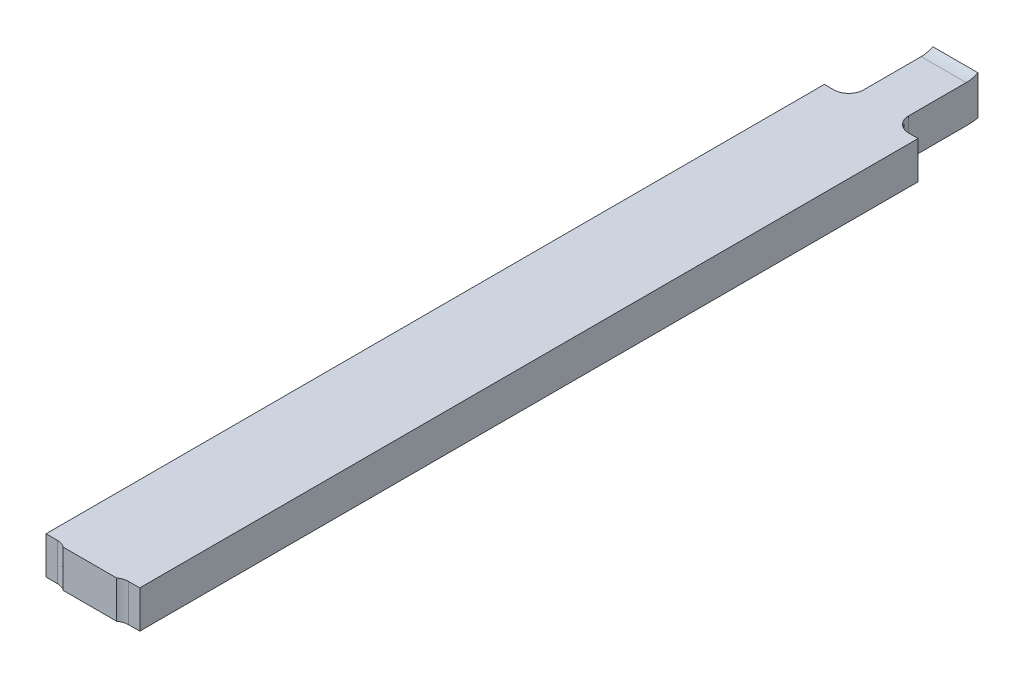
ISO-10303-21;
HEADER;
FILE_DESCRIPTION(('STEP AP214'),'2;1');
FILE_NAME('part.step','',(''),(''),'','','');
FILE_SCHEMA(('AUTOMOTIVE_DESIGN { 1 0 10303 214 1 1 1 1 }'));
ENDSEC;
DATA;
#1=APPLICATION_CONTEXT('core data for automotive mechanical design processes');
#2=APPLICATION_PROTOCOL_DEFINITION('international standard','automotive_design',2000,#1);
#3=PRODUCT_CONTEXT('',#1,'mechanical');
#4=PRODUCT('Part','Part','',(#3));
#5=PRODUCT_RELATED_PRODUCT_CATEGORY('part','',(#4));
#6=PRODUCT_DEFINITION_FORMATION('','',#4);
#7=PRODUCT_DEFINITION_CONTEXT('part definition',#1,'design');
#8=PRODUCT_DEFINITION('design','',#6,#7);
#9=PRODUCT_DEFINITION_SHAPE('','',#8);
#10=(LENGTH_UNIT() NAMED_UNIT(*) SI_UNIT(.MILLI.,.METRE.));
#11=(NAMED_UNIT(*) PLANE_ANGLE_UNIT() SI_UNIT($,.RADIAN.));
#12=(NAMED_UNIT(*) SI_UNIT($,.STERADIAN.) SOLID_ANGLE_UNIT());
#13=UNCERTAINTY_MEASURE_WITH_UNIT(LENGTH_MEASURE(1.E-05),#10,'distance_accuracy_value','');
#14=(GEOMETRIC_REPRESENTATION_CONTEXT(3) GLOBAL_UNCERTAINTY_ASSIGNED_CONTEXT((#13)) GLOBAL_UNIT_ASSIGNED_CONTEXT((#10,
#11,#12)) REPRESENTATION_CONTEXT('',''));
#15=CARTESIAN_POINT('',(0.,0.,0.));
#16=DIRECTION('',(0.,0.,1.));
#17=DIRECTION('',(1.,0.,0.));
#18=AXIS2_PLACEMENT_3D('',#15,#16,#17);
#19=CARTESIAN_POINT('',(0.,-0.3652289464185,-7.500488855463));
#20=DIRECTION('',(0.,0.,1.));
#21=DIRECTION('',(1.,0.,0.));
#22=AXIS2_PLACEMENT_3D('',#19,#20,#21);
#23=PLANE('',#22);
#24=DIRECTION('',(0.,1.,0.));
#25=VECTOR('',#24,1.);
#26=CARTESIAN_POINT('',(0.12,-0.3694122088881,-7.500488855463));
#27=LINE('',#26,#25);
#28=CARTESIAN_POINT('',(0.12,-0.469296338681694,-7.50048885546298));
#29=VERTEX_POINT('',#28);
#30=CARTESIAN_POINT('',(0.12,-0.261161554155171,-7.50048885546301));
#31=VERTEX_POINT('',#30);
#32=EDGE_CURVE('E150',#29,#31,#27,.T.);
#33=ORIENTED_EDGE('',*,*,#32,.F.);
#34=DIRECTION('',(-1.,0.,0.));
#35=VECTOR('',#34,1.);
#36=CARTESIAN_POINT('',(0.125727283719,-0.469296338681697,-7.50048885546296));
#37=LINE('',#36,#35);
#38=CARTESIAN_POINT('',(-0.12,-0.469296338681694,-7.50048885546298));
#39=VERTEX_POINT('',#38);
#40=EDGE_CURVE('E139',#39,#29,#37,.F.);
#41=ORIENTED_EDGE('',*,*,#40,.F.);
#42=DIRECTION('',(0.,1.,0.));
#43=VECTOR('',#42,1.);
#44=CARTESIAN_POINT('',(-0.12,-0.3694122088881,-7.500488855463));
#45=LINE('',#44,#43);
#46=CARTESIAN_POINT('',(-0.12,-0.261161554155171,-7.50048885546301));
#47=VERTEX_POINT('',#46);
#48=EDGE_CURVE('E535',#39,#47,#45,.T.);
#49=ORIENTED_EDGE('',*,*,#48,.T.);
#50=DIRECTION('',(1.,0.,0.));
#51=VECTOR('',#50,1.);
#52=CARTESIAN_POINT('',(-0.125727283719,-0.261161554155164,-7.50048885546303));
#53=LINE('',#52,#51);
#54=EDGE_CURVE('E147',#47,#31,#53,.T.);
#55=ORIENTED_EDGE('',*,*,#54,.T.);
#56=EDGE_LOOP('',(#33,#41,#49,#55));
#57=FACE_BOUND('',#56,.T.);
#58=ADVANCED_FACE('F17',(#57),#23,.F.);
#59=CARTESIAN_POINT('',(0.125727283719,-0.125,-7.43756007691));
#60=DIRECTION('',(-1.,0.,0.));
#61=DIRECTION('',(0.,0.,1.));
#62=AXIS2_PLACEMENT_3D('',#59,#60,#61);
#63=CYLINDRICAL_SURFACE('',#62,0.3499999999997);
#64=CARTESIAN_POINT('',(-0.12,-0.125,-7.43756007691));
#65=DIRECTION('',(-1.,0.,0.));
#66=DIRECTION('',(0.,0.,1.));
#67=AXIS2_PLACEMENT_3D('',#64,#65,#66);
#68=CIRCLE('',#67,0.3499999999997);
#69=CARTESIAN_POINT('',(-0.12,-0.475,-7.43756007691));
#70=VERTEX_POINT('',#69);
#71=EDGE_CURVE('E250',#70,#39,#68,.F.);
#72=ORIENTED_EDGE('',*,*,#71,.T.);
#73=ORIENTED_EDGE('',*,*,#40,.T.);
#74=CARTESIAN_POINT('',(0.12,-0.125,-7.43756007691));
#75=DIRECTION('',(-1.,0.,0.));
#76=DIRECTION('',(0.,0.,1.));
#77=AXIS2_PLACEMENT_3D('',#74,#75,#76);
#78=CIRCLE('',#77,0.3499999999997);
#79=CARTESIAN_POINT('',(0.12,-0.475,-7.43756007691));
#80=VERTEX_POINT('',#79);
#81=EDGE_CURVE('E274',#80,#29,#78,.F.);
#82=ORIENTED_EDGE('',*,*,#81,.F.);
#83=DIRECTION('',(1.,0.,0.));
#84=VECTOR('',#83,1.);
#85=CARTESIAN_POINT('',(0.,-0.475,-7.43756007691));
#86=LINE('',#85,#84);
#87=EDGE_CURVE('E138',#80,#70,#86,.F.);
#88=ORIENTED_EDGE('',*,*,#87,.T.);
#89=EDGE_LOOP('',(#72,#73,#82,#88));
#90=FACE_BOUND('',#89,.T.);
#91=ADVANCED_FACE('F255',(#90),#63,.T.);
#92=CARTESIAN_POINT('',(0.,-0.475,-5.160844573418));
#93=DIRECTION('',(0.,1.,0.));
#94=DIRECTION('',(0.,0.,1.));
#95=AXIS2_PLACEMENT_3D('',#92,#93,#94);
#96=PLANE('',#95);
#97=DIRECTION('',(1.,0.,0.));
#98=VECTOR('',#97,1.);
#99=CARTESIAN_POINT('',(0.,-0.475,-2.9));
#100=LINE('',#99,#98);
#101=CARTESIAN_POINT('',(-0.25,-0.475,-2.9));
#102=VERTEX_POINT('',#101);
#103=CARTESIAN_POINT('',(-0.190000000000001,-0.475,-2.89999999999976));
#104=VERTEX_POINT('',#103);
#105=EDGE_CURVE('E118',#102,#104,#100,.T.);
#106=ORIENTED_EDGE('',*,*,#105,.F.);
#107=DIRECTION('',(0.,0.,-1.));
#108=VECTOR('',#107,1.);
#109=CARTESIAN_POINT('',(-0.25,-0.475,-4.975579331992));
#110=LINE('',#109,#108);
#111=CARTESIAN_POINT('',(-0.25,-0.475,-7.051158663985));
#112=VERTEX_POINT('',#111);
#113=EDGE_CURVE('E213',#102,#112,#110,.T.);
#114=ORIENTED_EDGE('',*,*,#113,.T.);
#115=DIRECTION('',(1.,0.,0.));
#116=VECTOR('',#115,1.);
#117=CARTESIAN_POINT('',(-0.225,-0.475,-7.051158663985));
#118=LINE('',#117,#116);
#119=CARTESIAN_POINT('',(-0.2,-0.475,-7.05115866398505));
#120=VERTEX_POINT('',#119);
#121=EDGE_CURVE('E218',#112,#120,#118,.T.);
#122=ORIENTED_EDGE('',*,*,#121,.T.);
#123=CARTESIAN_POINT('',(-0.119999999999862,-0.475,-7.131158663985));
#124=CARTESIAN_POINT('',(-0.120008875595071,-0.475,-7.12663228539935));
#125=CARTESIAN_POINT('',(-0.120395030473366,-0.475,-7.12211245444005));
#126=CARTESIAN_POINT('',(-0.12191562674169,-0.475,-7.11320506981176));
#127=CARTESIAN_POINT('',(-0.123049393101386,-0.475,-7.1088174005455));
#128=CARTESIAN_POINT('',(-0.127556185534975,-0.475,-7.09604021502303));
#129=CARTESIAN_POINT('',(-0.13203481865204,-0.475,-7.08801257628803));
#130=CARTESIAN_POINT('',(-0.143341188645396,-0.475,-7.07397145931023));
#131=CARTESIAN_POINT('',(-0.150149074871609,-0.475,-7.06794178198232));
#132=CARTESIAN_POINT('',(-0.165429815683723,-0.475,-7.05845747919254));
#133=CARTESIAN_POINT('',(-0.173910916248762,-0.475,-7.05501603051785));
#134=CARTESIAN_POINT('',(-0.188384508673165,-0.475,-7.05178938735775));
#135=CARTESIAN_POINT('',(-0.194196600392803,-0.475,-7.05114165155808));
#136=CARTESIAN_POINT('',(-0.199999999999999,-0.475,-7.05115866398511));
#137=B_SPLINE_CURVE_WITH_KNOTS('',3,(#123,#124,#125,#126,#127,#128,#129,#130,#131,#132,#133,
#134,#135,#136),.UNSPECIFIED.,.F.,.F.,(4,2,2,2,2,2,4),(0.,0.013551279219363,0.0270903394959934,
0.0541002294506428,0.0808854407505694,0.107806110467615,0.125207976056657),.UNSPECIFIED.);
#138=CARTESIAN_POINT('',(-0.119999999999931,-0.475,-7.131158663985));
#139=VERTEX_POINT('',#138);
#140=EDGE_CURVE('E239',#139,#120,#137,.T.);
#141=ORIENTED_EDGE('',*,*,#140,.F.);
#142=DIRECTION('',(0.,0.,-1.));
#143=VECTOR('',#142,1.);
#144=CARTESIAN_POINT('',(-0.12,-0.475,-7.317732357319));
#145=LINE('',#144,#143);
#146=EDGE_CURVE('E537',#139,#70,#145,.T.);
#147=ORIENTED_EDGE('',*,*,#146,.T.);
#148=ORIENTED_EDGE('',*,*,#87,.F.);
#149=DIRECTION('',(0.,0.,-1.));
#150=VECTOR('',#149,1.);
#151=CARTESIAN_POINT('',(0.12,-0.475,-7.317732357319));
#152=LINE('',#151,#150);
#153=CARTESIAN_POINT('',(0.120000000000094,-0.475,-7.131158663985));
#154=VERTEX_POINT('',#153);
#155=EDGE_CURVE('E533',#154,#80,#152,.T.);
#156=ORIENTED_EDGE('',*,*,#155,.F.);
#157=CARTESIAN_POINT('',(0.199999999999999,-0.475,-7.05115866398468));
#158=CARTESIAN_POINT('',(0.19547362141462,-0.475,-7.05116753957989));
#159=CARTESIAN_POINT('',(0.190953790455594,-0.475,-7.05155369445816));
#160=CARTESIAN_POINT('',(0.182046405827844,-0.475,-7.05307429072637));
#161=CARTESIAN_POINT('',(0.177658736561845,-0.475,-7.05420805708598));
#162=CARTESIAN_POINT('',(0.16488155104013,-0.475,-7.05871484951908));
#163=CARTESIAN_POINT('',(0.156853912305541,-0.475,-7.06319348263554));
#164=CARTESIAN_POINT('',(0.142812795327681,-0.475,-7.0744998526279));
#165=CARTESIAN_POINT('',(0.136783117999443,-0.475,-7.0813077388539));
#166=CARTESIAN_POINT('',(0.127298815208994,-0.475,-7.09658847966568));
#167=CARTESIAN_POINT('',(0.12385736653397,-0.475,-7.10506958023059));
#168=CARTESIAN_POINT('',(0.120630723373056,-0.475,-7.11954317265596));
#169=CARTESIAN_POINT('',(0.119982987573148,-0.475,-7.1253552643767));
#170=CARTESIAN_POINT('',(0.120000000000187,-0.475,-7.131158663985));
#171=B_SPLINE_CURVE_WITH_KNOTS('',3,(#157,#158,#159,#160,#161,#162,#163,#164,#165,#166,#167,
#168,#169,#170),.UNSPECIFIED.,.F.,.F.,(4,2,2,2,2,2,4),(0.,0.0135512792185402,0.0270903394943603,
0.0541002294472016,0.0808854407472633,0.107806110464356,0.125207976056684),.UNSPECIFIED.);
#172=CARTESIAN_POINT('',(0.2,-0.475,-7.05115866398484));
#173=VERTEX_POINT('',#172);
#174=EDGE_CURVE('E266',#173,#154,#171,.T.);
#175=ORIENTED_EDGE('',*,*,#174,.F.);
#176=DIRECTION('',(1.,0.,0.));
#177=VECTOR('',#176,1.);
#178=CARTESIAN_POINT('',(0.225,-0.475,-7.051158663985));
#179=LINE('',#178,#177);
#180=CARTESIAN_POINT('',(0.25,-0.475,-7.051158663985));
#181=VERTEX_POINT('',#180);
#182=EDGE_CURVE('E151',#173,#181,#179,.T.);
#183=ORIENTED_EDGE('',*,*,#182,.T.);
#184=DIRECTION('',(0.,0.,-1.));
#185=VECTOR('',#184,1.);
#186=CARTESIAN_POINT('',(0.25,-0.475,-4.975579331992));
#187=LINE('',#186,#185);
#188=CARTESIAN_POINT('',(0.25,-0.475,-2.9));
#189=VERTEX_POINT('',#188);
#190=EDGE_CURVE('E155',#189,#181,#187,.T.);
#191=ORIENTED_EDGE('',*,*,#190,.F.);
#192=DIRECTION('',(1.,0.,0.));
#193=VECTOR('',#192,1.);
#194=CARTESIAN_POINT('',(0.22,-0.475,-2.9));
#195=LINE('',#194,#193);
#196=CARTESIAN_POINT('',(0.19,-0.475,-2.89999999999989));
#197=VERTEX_POINT('',#196);
#198=EDGE_CURVE('E163',#197,#189,#195,.T.);
#199=ORIENTED_EDGE('',*,*,#198,.F.);
#200=CARTESIAN_POINT('',(0.142175447578929,-0.475,-2.88412906992499));
#201=CARTESIAN_POINT('',(0.14622022070483,-0.475,-2.88715347788669));
#202=CARTESIAN_POINT('',(0.150554425820849,-0.475,-2.88978498732682));
#203=CARTESIAN_POINT('',(0.159133694976251,-0.475,-2.8939430866675));
#204=CARTESIAN_POINT('',(0.163335184108649,-0.475,-2.89555994023146));
#205=CARTESIAN_POINT('',(0.171948809421105,-0.475,-2.89806057790434));
#206=CARTESIAN_POINT('',(0.176360811048274,-0.475,-2.89894482380678));
#207=CARTESIAN_POINT('',(0.183863634830222,-0.475,-2.89981357444955));
#208=CARTESIAN_POINT('',(0.186932841567499,-0.475,-2.89999375978713));
#209=CARTESIAN_POINT('',(0.190000000000001,-0.475,-2.89999999999978));
#210=B_SPLINE_CURVE_WITH_KNOTS('',3,(#200,#201,#202,#203,#204,#205,#206,#207,#208,#209),
.UNSPECIFIED.,.F.,.F.,(4,2,2,2,4),(0.,0.0151223248429865,0.0285648972656435,0.0419989898072053,
0.0512012871013707),.UNSPECIFIED.);
#211=CARTESIAN_POINT('',(0.142175447578965,-0.475,-2.88412906992499));
#212=VERTEX_POINT('',#211);
#213=EDGE_CURVE('E125',#212,#197,#210,.T.);
#214=ORIENTED_EDGE('',*,*,#213,.F.);
#215=DIRECTION('',(1.,0.,0.));
#216=VECTOR('',#215,1.);
#217=CARTESIAN_POINT('',(0.,-0.475,-2.884129069925));
#218=LINE('',#217,#216);
#219=CARTESIAN_POINT('',(-0.142175433627938,-0.475,-2.88412906992503));
#220=VERTEX_POINT('',#219);
#221=EDGE_CURVE('E129',#220,#212,#218,.T.);
#222=ORIENTED_EDGE('',*,*,#221,.F.);
#223=CARTESIAN_POINT('',(-0.190000000000001,-0.475,-2.89999999999952));
#224=CARTESIAN_POINT('',(-0.184967303618337,-0.475,-2.90001482409388));
#225=CARTESIAN_POINT('',(-0.179918157833058,-0.475,-2.8995255759674));
#226=CARTESIAN_POINT('',(-0.16614771604925,-0.475,-2.89686256447201));
#227=CARTESIAN_POINT('',(-0.157600523919408,-0.475,-2.89367998586967));
#228=CARTESIAN_POINT('',(-0.147192134299259,-0.475,-2.88765952253259));
#229=CARTESIAN_POINT('',(-0.144625598716379,-0.475,-2.88596721904199));
#230=CARTESIAN_POINT('',(-0.142175433627878,-0.475,-2.88412906992507));
#231=B_SPLINE_CURVE_WITH_KNOTS('',3,(#223,#224,#225,#226,#227,#228,#229,#230),.UNSPECIFIED.,.F.,
.F.,(4,2,2,4),(0.,0.0151178951010566,0.0419060489790331,0.0511063402020565),.UNSPECIFIED.);
#232=EDGE_CURVE('E20',#104,#220,#231,.T.);
#233=ORIENTED_EDGE('',*,*,#232,.F.);
#234=EDGE_LOOP('',(#106,#114,#122,#141,#147,#148,#156,#175,#183,#191,#199,#214,#222,#233));
#235=FACE_BOUND('',#234,.T.);
#236=ADVANCED_FACE('F135',(#235),#96,.F.);
#237=CARTESIAN_POINT('',(0.192867608479,-0.269272716281,-2.899957930186));
#238=CARTESIAN_POINT('',(0.1919126755175,-0.269272716281,-2.899988554812));
#239=CARTESIAN_POINT('',(0.1857314876581,-0.269272716281,-2.900079343105));
#240=CARTESIAN_POINT('',(0.174291413689,-0.269272716281,-2.898963559635));
#241=CARTESIAN_POINT('',(0.159190917084,-0.269272716281,-2.894390814224));
#242=CARTESIAN_POINT('',(0.1486873263004,-0.269272716281,-2.888776760997));
#243=CARTESIAN_POINT('',(0.1417210231672,-0.269272716281,-2.883851645707));
#244=CARTESIAN_POINT('',(0.1391520518612,-0.269272716281,-2.881786274905));
#245=CARTESIAN_POINT('',(0.137705478113,-0.269272716281,-2.880535760883));
#246=(BOUNDED_CURVE() B_SPLINE_CURVE(3,(#237,#238,#239,#240,#241,#242,#243,#244,#245),
.UNSPECIFIED.,.F.,.F.) B_SPLINE_CURVE_WITH_KNOTS((4,1,1,1,1,1,4),(0.,0.04800761261446,
0.3103664664123,0.5726487803867,0.834938301322,0.9041878403021,1.),
.UNSPECIFIED.) CURVE() GEOMETRIC_REPRESENTATION_ITEM() RATIONAL_B_SPLINE_CURVE((1.,1.,1.,1.,1.,
1.,1.,1.,1.)) REPRESENTATION_ITEM(''));
#247=DIRECTION('',(0.,-1.,0.));
#248=VECTOR('',#247,1.);
#249=SURFACE_OF_LINEAR_EXTRUSION('',#246,#248);
#250=CARTESIAN_POINT('',(0.142175444647537,-0.275,-2.88412906773645));
#251=CARTESIAN_POINT('',(0.146220217634447,-0.275,-2.88715347588338));
#252=CARTESIAN_POINT('',(0.150554422629909,-0.275,-2.88978498552229));
#253=CARTESIAN_POINT('',(0.159133691593947,-0.275,-2.89394308525614));
#254=CARTESIAN_POINT('',(0.163335180651341,-0.275,-2.89555993901262));
#255=CARTESIAN_POINT('',(0.171948805848853,-0.275,-2.89806057708091));
#256=CARTESIAN_POINT('',(0.176360807436171,-0.275,-2.89894482318585));
#257=CARTESIAN_POINT('',(0.183863632392306,-0.275,-2.89981357430856));
#258=CARTESIAN_POINT('',(0.186932840348679,-0.275,-2.89999375978683));
#259=CARTESIAN_POINT('',(0.190000000000001,-0.275,-2.89999999999978));
#260=B_SPLINE_CURVE_WITH_KNOTS('',3,(#250,#251,#252,#253,#254,#255,#256,#257,#258,#259),
.UNSPECIFIED.,.F.,.F.,(4,2,2,2,4),(0.,0.0151223248428165,0.0285648972625835,0.041998989808199,
0.0512012907536293),.UNSPECIFIED.);
#261=CARTESIAN_POINT('',(0.142175446113268,-0.275,-2.88412906883072));
#262=VERTEX_POINT('',#261);
#263=CARTESIAN_POINT('',(0.19,-0.275,-2.9));
#264=VERTEX_POINT('',#263);
#265=EDGE_CURVE('E132',#262,#264,#260,.T.);
#266=ORIENTED_EDGE('',*,*,#265,.F.);
#267=DIRECTION('',(0.,1.,0.));
#268=VECTOR('',#267,1.);
#269=CARTESIAN_POINT('',(0.142175447579,-0.375,-2.884129069925));
#270=LINE('',#269,#268);
#271=EDGE_CURVE('E133',#212,#262,#270,.T.);
#272=ORIENTED_EDGE('',*,*,#271,.F.);
#273=ORIENTED_EDGE('',*,*,#213,.T.);
#274=DIRECTION('',(0.,1.,0.));
#275=VECTOR('',#274,1.);
#276=CARTESIAN_POINT('',(0.19,-0.375,-2.9));
#277=LINE('',#276,#275);
#278=EDGE_CURVE('E166',#264,#197,#277,.F.);
#279=ORIENTED_EDGE('',*,*,#278,.F.);
#280=EDGE_LOOP('',(#266,#272,#273,#279));
#281=FACE_BOUND('',#280,.T.);
#282=ADVANCED_FACE('F254',(#281),#249,.T.);
#283=CARTESIAN_POINT('',(0.22,-0.375,-2.9));
#284=DIRECTION('',(0.,0.,1.));
#285=DIRECTION('',(1.,0.,0.));
#286=AXIS2_PLACEMENT_3D('',#283,#284,#285);
#287=PLANE('',#286);
#288=DIRECTION('',(0.,1.,0.));
#289=VECTOR('',#288,1.);
#290=CARTESIAN_POINT('',(0.25,-0.375,-2.9));
#291=LINE('',#290,#289);
#292=CARTESIAN_POINT('',(0.25,-0.275,-2.9));
#293=VERTEX_POINT('',#292);
#294=EDGE_CURVE('E160',#293,#189,#291,.F.);
#295=ORIENTED_EDGE('',*,*,#294,.F.);
#296=DIRECTION('',(1.,0.,0.));
#297=VECTOR('',#296,1.);
#298=CARTESIAN_POINT('',(0.,-0.275,-2.9));
#299=LINE('',#298,#297);
#300=EDGE_CURVE('E306',#264,#293,#299,.T.);
#301=ORIENTED_EDGE('',*,*,#300,.F.);
#302=ORIENTED_EDGE('',*,*,#278,.T.);
#303=ORIENTED_EDGE('',*,*,#198,.T.);
#304=EDGE_LOOP('',(#295,#301,#302,#303));
#305=FACE_BOUND('',#304,.T.);
#306=ADVANCED_FACE('F368',(#305),#287,.T.);
#307=CARTESIAN_POINT('',(0.25,-0.375,-4.975579331992));
#308=DIRECTION('',(1.,0.,0.));
#309=DIRECTION('',(0.,0.,-1.));
#310=AXIS2_PLACEMENT_3D('',#307,#308,#309);
#311=PLANE('',#310);
#312=DIRECTION('',(0.,1.,0.));
#313=VECTOR('',#312,1.);
#314=CARTESIAN_POINT('',(0.25,-0.375,-7.051158663985));
#315=LINE('',#314,#313);
#316=CARTESIAN_POINT('',(0.25,-0.275,-7.051158663985));
#317=VERTEX_POINT('',#316);
#318=EDGE_CURVE('E154',#181,#317,#315,.T.);
#319=ORIENTED_EDGE('',*,*,#318,.T.);
#320=DIRECTION('',(0.,0.,1.));
#321=VECTOR('',#320,1.);
#322=CARTESIAN_POINT('',(0.25,-0.275,-5.160844573418));
#323=LINE('',#322,#321);
#324=EDGE_CURVE('E302',#293,#317,#323,.F.);
#325=ORIENTED_EDGE('',*,*,#324,.F.);
#326=ORIENTED_EDGE('',*,*,#294,.T.);
#327=ORIENTED_EDGE('',*,*,#190,.T.);
#328=EDGE_LOOP('',(#319,#325,#326,#327));
#329=FACE_BOUND('',#328,.T.);
#330=ADVANCED_FACE('F373',(#329),#311,.T.);
#331=CARTESIAN_POINT('',(0.225,-0.375,-7.051158663985));
#332=DIRECTION('',(0.,0.,1.));
#333=DIRECTION('',(1.,0.,0.));
#334=AXIS2_PLACEMENT_3D('',#331,#332,#333);
#335=PLANE('',#334);
#336=ORIENTED_EDGE('',*,*,#182,.F.);
#337=DIRECTION('',(0.,-1.,0.));
#338=VECTOR('',#337,1.);
#339=CARTESIAN_POINT('',(0.199999999999999,-0.269272716281,-7.05115866398468));
#340=LINE('',#339,#338);
#341=CARTESIAN_POINT('',(0.199999999999999,-0.275,-7.05115866398476));
#342=VERTEX_POINT('',#341);
#343=EDGE_CURVE('E273',#342,#173,#340,.T.);
#344=ORIENTED_EDGE('',*,*,#343,.F.);
#345=DIRECTION('',(1.,0.,0.));
#346=VECTOR('',#345,1.);
#347=CARTESIAN_POINT('',(0.,-0.275,-7.051158663985));
#348=LINE('',#347,#346);
#349=EDGE_CURVE('E305',#317,#342,#348,.F.);
#350=ORIENTED_EDGE('',*,*,#349,.F.);
#351=ORIENTED_EDGE('',*,*,#318,.F.);
#352=EDGE_LOOP('',(#336,#344,#350,#351));
#353=FACE_BOUND('',#352,.T.);
#354=ADVANCED_FACE('F283',(#353),#335,.F.);
#355=CARTESIAN_POINT('',(0.1200420704128,-0.269272716281,-7.134026291144));
#356=CARTESIAN_POINT('',(0.120011445371,-0.269272716281,-7.133071351971));
#357=CARTESIAN_POINT('',(0.1199206562853,-0.269272716281,-7.126890157897));
#358=CARTESIAN_POINT('',(0.121036440365,-0.269272716281,-7.115450077674));
#359=CARTESIAN_POINT('',(0.125609185776,-0.269272716281,-7.100349581069));
#360=CARTESIAN_POINT('',(0.133048947975,-0.269272716281,-7.086430187272));
#361=CARTESIAN_POINT('',(0.143068695624,-0.269272716281,-7.074236320435));
#362=CARTESIAN_POINT('',(0.155262096496,-0.269272716281,-7.064213675467));
#363=CARTESIAN_POINT('',(0.169183798376,-0.269272716281,-7.056770327068));
#364=CARTESIAN_POINT('',(0.1842879595079,-0.269272716281,-7.05219575577));
#365=CARTESIAN_POINT('',(0.1957295145964,-0.269272716281,-7.051079350384));
#366=CARTESIAN_POINT('',(0.2019106792612,-0.269272716281,-7.051170096432));
#367=CARTESIAN_POINT('',(0.2028646187409,-0.269272716281,-7.0512006723));
#368=(BOUNDED_CURVE() B_SPLINE_CURVE(3,(#355,#356,#357,#358,#359,#360,#361,#362,#363,#364,#365,
#366,#367),.UNSPECIFIED.,.F.,.F.) B_SPLINE_CURVE_WITH_KNOTS((4,1,1,1,1,1,1,1,1,1,4),(0.,
0.0218736690153,0.1414112381415,0.2609139337195,0.3804199129777,0.4999590271862,0.6195124003903,
0.7390518477019,0.8585895788749,0.9781493142556,1.),
.UNSPECIFIED.) CURVE() GEOMETRIC_REPRESENTATION_ITEM() RATIONAL_B_SPLINE_CURVE((1.,1.,1.,1.,1.,
1.,1.,1.,1.,1.,1.,1.,1.)) REPRESENTATION_ITEM(''));
#369=DIRECTION('',(0.,-1.,0.));
#370=VECTOR('',#369,1.);
#371=SURFACE_OF_LINEAR_EXTRUSION('',#368,#370);
#372=DIRECTION('',(0.,1.,0.));
#373=VECTOR('',#372,1.);
#374=CARTESIAN_POINT('',(0.12,-0.3694122088881,-7.131158663985));
#375=LINE('',#374,#373);
#376=CARTESIAN_POINT('',(0.12000000000005,-0.275,-7.131158663985));
#377=VERTEX_POINT('',#376);
#378=EDGE_CURVE('E272',#377,#154,#375,.F.);
#379=ORIENTED_EDGE('',*,*,#378,.F.);
#380=CARTESIAN_POINT('',(0.199999999999999,-0.275,-7.05115866398468));
#381=CARTESIAN_POINT('',(0.19547362141462,-0.275,-7.05116753957989));
#382=CARTESIAN_POINT('',(0.190953790455594,-0.275,-7.05155369445816));
#383=CARTESIAN_POINT('',(0.182046405827844,-0.275,-7.05307429072637));
#384=CARTESIAN_POINT('',(0.177658736561845,-0.275,-7.05420805708598));
#385=CARTESIAN_POINT('',(0.16488155104013,-0.275,-7.05871484951908));
#386=CARTESIAN_POINT('',(0.156853912305541,-0.275,-7.06319348263554));
#387=CARTESIAN_POINT('',(0.142812795327681,-0.275,-7.0744998526279));
#388=CARTESIAN_POINT('',(0.136783117999443,-0.275,-7.0813077388539));
#389=CARTESIAN_POINT('',(0.127298815208994,-0.275,-7.09658847966568));
#390=CARTESIAN_POINT('',(0.12385736653397,-0.275,-7.10506958023059));
#391=CARTESIAN_POINT('',(0.120630723373056,-0.275,-7.11954317265596));
#392=CARTESIAN_POINT('',(0.119982987573148,-0.275,-7.1253552643767));
#393=CARTESIAN_POINT('',(0.120000000000187,-0.275,-7.131158663985));
#394=B_SPLINE_CURVE_WITH_KNOTS('',3,(#380,#381,#382,#383,#384,#385,#386,#387,#388,#389,#390,
#391,#392,#393),.UNSPECIFIED.,.F.,.F.,(4,2,2,2,2,2,4),(0.,0.0135512792185402,0.0270903394943603,
0.0541002294472016,0.0808854407472633,0.107806110464356,0.125207976056686),.UNSPECIFIED.);
#395=EDGE_CURVE('E355',#342,#377,#394,.T.);
#396=ORIENTED_EDGE('',*,*,#395,.F.);
#397=ORIENTED_EDGE('',*,*,#343,.T.);
#398=ORIENTED_EDGE('',*,*,#174,.T.);
#399=EDGE_LOOP('',(#379,#396,#397,#398));
#400=FACE_BOUND('',#399,.T.);
#401=ADVANCED_FACE('F276',(#400),#371,.T.);
#402=CARTESIAN_POINT('',(0.12,-0.3694122088881,-7.317732357319));
#403=DIRECTION('',(1.,0.,0.));
#404=DIRECTION('',(0.,0.,-1.));
#405=AXIS2_PLACEMENT_3D('',#402,#403,#404);
#406=PLANE('',#405);
#407=ORIENTED_EDGE('',*,*,#81,.T.);
#408=ORIENTED_EDGE('',*,*,#32,.T.);
#409=CARTESIAN_POINT('',(0.12,-0.125,-7.437560076911));
#410=DIRECTION('',(1.,0.,0.));
#411=DIRECTION('',(0.,0.,-1.));
#412=AXIS2_PLACEMENT_3D('',#409,#410,#411);
#413=CIRCLE('',#412,0.15);
#414=CARTESIAN_POINT('',(0.12000000000005,-0.275,-7.437560076911));
#415=VERTEX_POINT('',#414);
#416=EDGE_CURVE('E149',#31,#415,#413,.F.);
#417=ORIENTED_EDGE('',*,*,#416,.T.);
#418=DIRECTION('',(0.,0.,1.));
#419=VECTOR('',#418,1.);
#420=CARTESIAN_POINT('',(0.1200000000001,-0.275,-5.160844573418));
#421=LINE('',#420,#419);
#422=EDGE_CURVE('E348',#377,#415,#421,.F.);
#423=ORIENTED_EDGE('',*,*,#422,.F.);
#424=ORIENTED_EDGE('',*,*,#378,.T.);
#425=ORIENTED_EDGE('',*,*,#155,.T.);
#426=EDGE_LOOP('',(#407,#408,#417,#423,#424,#425));
#427=FACE_BOUND('',#426,.T.);
#428=ADVANCED_FACE('F282',(#427),#406,.T.);
#429=CARTESIAN_POINT('',(-0.125727283719,-0.125,-7.437560076911));
#430=DIRECTION('',(1.,0.,0.));
#431=DIRECTION('',(0.,0.,-1.));
#432=AXIS2_PLACEMENT_3D('',#429,#430,#431);
#433=CYLINDRICAL_SURFACE('',#432,0.15);
#434=DIRECTION('',(1.,0.,0.));
#435=VECTOR('',#434,1.);
#436=CARTESIAN_POINT('',(0.,-0.275,-7.437560076911));
#437=LINE('',#436,#435);
#438=CARTESIAN_POINT('',(-0.12,-0.275,-7.437560076911));
#439=VERTEX_POINT('',#438);
#440=EDGE_CURVE('E346',#415,#439,#437,.F.);
#441=ORIENTED_EDGE('',*,*,#440,.F.);
#442=ORIENTED_EDGE('',*,*,#416,.F.);
#443=ORIENTED_EDGE('',*,*,#54,.F.);
#444=CARTESIAN_POINT('',(-0.12,-0.125,-7.437560076911));
#445=DIRECTION('',(1.,0.,0.));
#446=DIRECTION('',(0.,0.,-1.));
#447=AXIS2_PLACEMENT_3D('',#444,#445,#446);
#448=CIRCLE('',#447,0.15);
#449=EDGE_CURVE('E536',#47,#439,#448,.F.);
#450=ORIENTED_EDGE('',*,*,#449,.T.);
#451=EDGE_LOOP('',(#441,#442,#443,#450));
#452=FACE_BOUND('',#451,.T.);
#453=ADVANCED_FACE('F443',(#452),#433,.F.);
#454=CARTESIAN_POINT('',(-0.12,-0.3694122088881,-7.317732357319));
#455=DIRECTION('',(1.,0.,0.));
#456=DIRECTION('',(0.,0.,-1.));
#457=AXIS2_PLACEMENT_3D('',#454,#455,#456);
#458=PLANE('',#457);
#459=ORIENTED_EDGE('',*,*,#146,.F.);
#460=DIRECTION('',(0.,-1.,0.));
#461=VECTOR('',#460,1.);
#462=CARTESIAN_POINT('',(-0.119999999999862,-0.269272716281,-7.131158663985));
#463=LINE('',#462,#461);
#464=CARTESIAN_POINT('',(-0.119999999999897,-0.275,-7.131158663985));
#465=VERTEX_POINT('',#464);
#466=EDGE_CURVE('E223',#465,#139,#463,.T.);
#467=ORIENTED_EDGE('',*,*,#466,.F.);
#468=DIRECTION('',(0.,0.,1.));
#469=VECTOR('',#468,1.);
#470=CARTESIAN_POINT('',(-0.12,-0.275,-5.160844573418));
#471=LINE('',#470,#469);
#472=EDGE_CURVE('E345',#439,#465,#471,.T.);
#473=ORIENTED_EDGE('',*,*,#472,.F.);
#474=ORIENTED_EDGE('',*,*,#449,.F.);
#475=ORIENTED_EDGE('',*,*,#48,.F.);
#476=ORIENTED_EDGE('',*,*,#71,.F.);
#477=EDGE_LOOP('',(#459,#467,#473,#474,#475,#476));
#478=FACE_BOUND('',#477,.T.);
#479=ADVANCED_FACE('F234',(#478),#458,.F.);
#480=CARTESIAN_POINT('',(-0.2028676271589,-0.269272716281,-7.051200734398));
#481=CARTESIAN_POINT('',(-0.2019126879861,-0.269272716281,-7.051170109356));
#482=CARTESIAN_POINT('',(-0.1957314939118,-0.269272716281,-7.05107932027));
#483=CARTESIAN_POINT('',(-0.184291413689,-0.269272716281,-7.05219510435));
#484=CARTESIAN_POINT('',(-0.169190917084,-0.269272716281,-7.056767849761));
#485=CARTESIAN_POINT('',(-0.155271523287,-0.269272716281,-7.06420761196));
#486=CARTESIAN_POINT('',(-0.14307765645,-0.269272716281,-7.074227359609));
#487=CARTESIAN_POINT('',(-0.133055011482,-0.269272716281,-7.086420760481));
#488=CARTESIAN_POINT('',(-0.125611663083,-0.269272716281,-7.100342462361));
#489=CARTESIAN_POINT('',(-0.121037091785,-0.269272716281,-7.115446623493));
#490=CARTESIAN_POINT('',(-0.1199206863994,-0.269272716281,-7.126888178581));
#491=CARTESIAN_POINT('',(-0.1200114324471,-0.269272716281,-7.133069343246));
#492=CARTESIAN_POINT('',(-0.1200420083152,-0.269272716281,-7.134023282726));
#493=(BOUNDED_CURVE() B_SPLINE_CURVE(3,(#480,#481,#482,#483,#484,#485,#486,#487,#488,#489,#490,
#491,#492),.UNSPECIFIED.,.F.,.F.) B_SPLINE_CURVE_WITH_KNOTS((4,1,1,1,1,1,1,1,1,1,4),(0.,
0.02187366901338,0.1414112381396,0.2609139337177,0.3804199129761,0.4999590271847,0.619512400389,
0.7390518477008,0.8585895788739,0.9781493142566,1.),
.UNSPECIFIED.) CURVE() GEOMETRIC_REPRESENTATION_ITEM() RATIONAL_B_SPLINE_CURVE((1.,1.,1.,1.,1.,
1.,1.,1.,1.,1.,1.,1.,1.)) REPRESENTATION_ITEM(''));
#494=DIRECTION('',(0.,-1.,0.));
#495=VECTOR('',#494,1.);
#496=SURFACE_OF_LINEAR_EXTRUSION('',#493,#495);
#497=DIRECTION('',(0.,1.,0.));
#498=VECTOR('',#497,1.);
#499=CARTESIAN_POINT('',(-0.2,-0.375,-7.051158663985));
#500=LINE('',#499,#498);
#501=CARTESIAN_POINT('',(-0.2,-0.275,-7.051158663985));
#502=VERTEX_POINT('',#501);
#503=EDGE_CURVE('E216',#120,#502,#500,.T.);
#504=ORIENTED_EDGE('',*,*,#503,.T.);
#505=CARTESIAN_POINT('',(-0.119999999999862,-0.275,-7.131158663985));
#506=CARTESIAN_POINT('',(-0.120008875595071,-0.275,-7.12663228539935));
#507=CARTESIAN_POINT('',(-0.120395030473366,-0.275,-7.12211245444005));
#508=CARTESIAN_POINT('',(-0.12191562674169,-0.275,-7.11320506981176));
#509=CARTESIAN_POINT('',(-0.123049393101386,-0.275,-7.1088174005455));
#510=CARTESIAN_POINT('',(-0.127556185534975,-0.275,-7.09604021502303));
#511=CARTESIAN_POINT('',(-0.13203481865204,-0.275,-7.08801257628803));
#512=CARTESIAN_POINT('',(-0.143341188645396,-0.275,-7.07397145931023));
#513=CARTESIAN_POINT('',(-0.150149074871609,-0.275,-7.06794178198232));
#514=CARTESIAN_POINT('',(-0.165429815683723,-0.275,-7.05845747919254));
#515=CARTESIAN_POINT('',(-0.173910916248762,-0.275,-7.05501603051785));
#516=CARTESIAN_POINT('',(-0.188384508673165,-0.275,-7.05178938735775));
#517=CARTESIAN_POINT('',(-0.194196600392803,-0.275,-7.05114165155808));
#518=CARTESIAN_POINT('',(-0.199999999999999,-0.275,-7.05115866398511));
#519=B_SPLINE_CURVE_WITH_KNOTS('',3,(#505,#506,#507,#508,#509,#510,#511,#512,#513,#514,#515,
#516,#517,#518),.UNSPECIFIED.,.F.,.F.,(4,2,2,2,2,2,4),(0.,0.013551279219363,0.0270903394959934,
0.0541002294506428,0.0808854407505694,0.107806110467615,0.125207976056657),.UNSPECIFIED.);
#520=EDGE_CURVE('E175',#465,#502,#519,.T.);
#521=ORIENTED_EDGE('',*,*,#520,.F.);
#522=ORIENTED_EDGE('',*,*,#466,.T.);
#523=ORIENTED_EDGE('',*,*,#140,.T.);
#524=EDGE_LOOP('',(#504,#521,#522,#523));
#525=FACE_BOUND('',#524,.T.);
#526=ADVANCED_FACE('F228',(#525),#496,.T.);
#527=CARTESIAN_POINT('',(-0.225,-0.375,-7.051158663985));
#528=DIRECTION('',(0.,0.,1.));
#529=DIRECTION('',(1.,0.,0.));
#530=AXIS2_PLACEMENT_3D('',#527,#528,#529);
#531=PLANE('',#530);
#532=ORIENTED_EDGE('',*,*,#121,.F.);
#533=DIRECTION('',(0.,1.,0.));
#534=VECTOR('',#533,1.);
#535=CARTESIAN_POINT('',(-0.25,-0.375,-7.051158663985));
#536=LINE('',#535,#534);
#537=CARTESIAN_POINT('',(-0.25,-0.275,-7.051158663985));
#538=VERTEX_POINT('',#537);
#539=EDGE_CURVE('E202',#112,#538,#536,.T.);
#540=ORIENTED_EDGE('',*,*,#539,.T.);
#541=DIRECTION('',(1.,0.,0.));
#542=VECTOR('',#541,1.);
#543=CARTESIAN_POINT('',(0.,-0.275,-7.051158663985));
#544=LINE('',#543,#542);
#545=EDGE_CURVE('E208',#502,#538,#544,.F.);
#546=ORIENTED_EDGE('',*,*,#545,.F.);
#547=ORIENTED_EDGE('',*,*,#503,.F.);
#548=EDGE_LOOP('',(#532,#540,#546,#547));
#549=FACE_BOUND('',#548,.T.);
#550=ADVANCED_FACE('F233',(#549),#531,.F.);
#551=CARTESIAN_POINT('',(-0.25,-0.375,-4.975579331992));
#552=DIRECTION('',(1.,0.,0.));
#553=DIRECTION('',(0.,0.,-1.));
#554=AXIS2_PLACEMENT_3D('',#551,#552,#553);
#555=PLANE('',#554);
#556=ORIENTED_EDGE('',*,*,#113,.F.);
#557=DIRECTION('',(0.,1.,0.));
#558=VECTOR('',#557,1.);
#559=CARTESIAN_POINT('',(-0.25,-0.375,-2.9));
#560=LINE('',#559,#558);
#561=CARTESIAN_POINT('',(-0.25,-0.275,-2.9));
#562=VERTEX_POINT('',#561);
#563=EDGE_CURVE('E200',#562,#102,#560,.F.);
#564=ORIENTED_EDGE('',*,*,#563,.F.);
#565=DIRECTION('',(0.,0.,1.));
#566=VECTOR('',#565,1.);
#567=CARTESIAN_POINT('',(-0.25,-0.275,-5.160844573418));
#568=LINE('',#567,#566);
#569=EDGE_CURVE('E205',#538,#562,#568,.T.);
#570=ORIENTED_EDGE('',*,*,#569,.F.);
#571=ORIENTED_EDGE('',*,*,#539,.F.);
#572=EDGE_LOOP('',(#556,#564,#570,#571));
#573=FACE_BOUND('',#572,.T.);
#574=ADVANCED_FACE('F384',(#573),#555,.F.);
#575=CARTESIAN_POINT('',(-0.22,-0.375,-2.9));
#576=DIRECTION('',(0.,0.,1.));
#577=DIRECTION('',(1.,0.,0.));
#578=AXIS2_PLACEMENT_3D('',#575,#576,#577);
#579=PLANE('',#578);
#580=DIRECTION('',(0.,-1.,0.));
#581=VECTOR('',#580,1.);
#582=CARTESIAN_POINT('',(-0.190000000000001,-0.269272716281,-2.89999999999951));
#583=LINE('',#582,#581);
#584=CARTESIAN_POINT('',(-0.190000000000001,-0.275,-2.89999999999964));
#585=VERTEX_POINT('',#584);
#586=EDGE_CURVE('E122',#585,#104,#583,.T.);
#587=ORIENTED_EDGE('',*,*,#586,.F.);
#588=DIRECTION('',(1.,0.,0.));
#589=VECTOR('',#588,1.);
#590=CARTESIAN_POINT('',(0.,-0.275,-2.9));
#591=LINE('',#590,#589);
#592=EDGE_CURVE('E174',#562,#585,#591,.T.);
#593=ORIENTED_EDGE('',*,*,#592,.F.);
#594=ORIENTED_EDGE('',*,*,#563,.T.);
#595=ORIENTED_EDGE('',*,*,#105,.T.);
#596=EDGE_LOOP('',(#587,#593,#594,#595));
#597=FACE_BOUND('',#596,.T.);
#598=ADVANCED_FACE('F188',(#597),#579,.T.);
#599=CARTESIAN_POINT('',(-0.137705468183,-0.269272716281,-2.880535754176));
#600=CARTESIAN_POINT('',(-0.1391520407855,-0.269272716281,-2.881786269205));
#601=CARTESIAN_POINT('',(-0.1417179025767,-0.269272716281,-2.88384914542));
#602=CARTESIAN_POINT('',(-0.1486817618714,-0.269272716281,-2.888773339751));
#603=CARTESIAN_POINT('',(-0.159183798376,-0.269272716281,-2.894388336917));
#604=CARTESIAN_POINT('',(-0.174287959508,-0.269272716281,-2.898962908215));
#605=CARTESIAN_POINT('',(-0.185729509199,-0.269272716281,-2.900079313074));
#606=CARTESIAN_POINT('',(-0.1919106684994,-0.269272716281,-2.89998856771));
#607=CARTESIAN_POINT('',(-0.1928646026179,-0.269272716281,-2.899957992201));
#608=(BOUNDED_CURVE() B_SPLINE_CURVE(3,(#599,#600,#601,#602,#603,#604,#605,#606,#607),
.UNSPECIFIED.,.F.,.F.) B_SPLINE_CURVE_WITH_KNOTS((4,1,1,1,1,1,4),(0.,0.09581704921318,
0.1648704820821,0.4272468470592,0.689619445294,0.9520403404257,1.),
.UNSPECIFIED.) CURVE() GEOMETRIC_REPRESENTATION_ITEM() RATIONAL_B_SPLINE_CURVE((1.,1.,1.,1.,1.,
1.,1.,1.,1.)) REPRESENTATION_ITEM(''));
#609=DIRECTION('',(0.,-1.,0.));
#610=VECTOR('',#609,1.);
#611=SURFACE_OF_LINEAR_EXTRUSION('',#608,#610);
#612=ORIENTED_EDGE('',*,*,#232,.T.);
#613=DIRECTION('',(0.,1.,0.));
#614=VECTOR('',#613,1.);
#615=CARTESIAN_POINT('',(-0.142175433628,-0.375,-2.884129069925));
#616=LINE('',#615,#614);
#617=CARTESIAN_POINT('',(-0.142175433628,-0.275,-2.884129069925));
#618=VERTEX_POINT('',#617);
#619=EDGE_CURVE('E40',#618,#220,#616,.F.);
#620=ORIENTED_EDGE('',*,*,#619,.F.);
#621=CARTESIAN_POINT('',(-0.190000000000001,-0.275,-2.89999999999952));
#622=CARTESIAN_POINT('',(-0.1849673036158,-0.275,-2.90001482409397));
#623=CARTESIAN_POINT('',(-0.179918157831436,-0.275,-2.89952557596746));
#624=CARTESIAN_POINT('',(-0.166147716052124,-0.275,-2.89686256447191));
#625=CARTESIAN_POINT('',(-0.157600523927373,-0.275,-2.89367998586939));
#626=CARTESIAN_POINT('',(-0.147192133246783,-0.275,-2.88765952192549));
#627=CARTESIAN_POINT('',(-0.144625596684311,-0.275,-2.88596721770697));
#628=CARTESIAN_POINT('',(-0.142175430714574,-0.275,-2.88412906775002));
#629=B_SPLINE_CURVE_WITH_KNOTS('',3,(#621,#622,#623,#624,#625,#626,#627,#628),.UNSPECIFIED.,.F.,
.F.,(4,2,2,4),(0.,0.0151178951010566,0.0419060489790331,0.0511063438316793),.UNSPECIFIED.);
#630=EDGE_CURVE('E31',#585,#618,#629,.T.);
#631=ORIENTED_EDGE('',*,*,#630,.F.);
#632=ORIENTED_EDGE('',*,*,#586,.T.);
#633=EDGE_LOOP('',(#612,#620,#631,#632));
#634=FACE_BOUND('',#633,.T.);
#635=ADVANCED_FACE('F121',(#634),#611,.T.);
#636=CARTESIAN_POINT('',(6.975500038697E-09,-0.375,-2.884129069925));
#637=DIRECTION('',(0.,0.,1.));
#638=DIRECTION('',(1.,0.,0.));
#639=AXIS2_PLACEMENT_3D('',#636,#637,#638);
#640=PLANE('',#639);
#641=ORIENTED_EDGE('',*,*,#619,.T.);
#642=ORIENTED_EDGE('',*,*,#221,.T.);
#643=ORIENTED_EDGE('',*,*,#271,.T.);
#644=DIRECTION('',(1.,0.,0.));
#645=VECTOR('',#644,1.);
#646=CARTESIAN_POINT('',(0.,-0.275,-2.884129069925));
#647=LINE('',#646,#645);
#648=EDGE_CURVE('E11',#618,#262,#647,.T.);
#649=ORIENTED_EDGE('',*,*,#648,.F.);
#650=EDGE_LOOP('',(#641,#642,#643,#649));
#651=FACE_BOUND('',#650,.T.);
#652=ADVANCED_FACE('F127',(#651),#640,.T.);
#653=CARTESIAN_POINT('',(0.,-0.275,-5.160844573418));
#654=DIRECTION('',(0.,1.,0.));
#655=DIRECTION('',(0.,0.,1.));
#656=AXIS2_PLACEMENT_3D('',#653,#654,#655);
#657=PLANE('',#656);
#658=ORIENTED_EDGE('',*,*,#630,.T.);
#659=ORIENTED_EDGE('',*,*,#648,.T.);
#660=ORIENTED_EDGE('',*,*,#265,.T.);
#661=ORIENTED_EDGE('',*,*,#300,.T.);
#662=ORIENTED_EDGE('',*,*,#324,.T.);
#663=ORIENTED_EDGE('',*,*,#349,.T.);
#664=ORIENTED_EDGE('',*,*,#395,.T.);
#665=ORIENTED_EDGE('',*,*,#422,.T.);
#666=ORIENTED_EDGE('',*,*,#440,.T.);
#667=ORIENTED_EDGE('',*,*,#472,.T.);
#668=ORIENTED_EDGE('',*,*,#520,.T.);
#669=ORIENTED_EDGE('',*,*,#545,.T.);
#670=ORIENTED_EDGE('',*,*,#569,.T.);
#671=ORIENTED_EDGE('',*,*,#592,.T.);
#672=EDGE_LOOP('',(#658,#659,#660,#661,#662,#663,#664,#665,#666,#667,#668,#669,#670,#671));
#673=FACE_BOUND('',#672,.T.);
#674=ADVANCED_FACE('F181',(#673),#657,.T.);
#675=CLOSED_SHELL('',(#58,#91,#236,#282,#306,#330,#354,#401,#428,#453,#479,#526,#550,#574,#598,
#635,#652,#674));
#676=MANIFOLD_SOLID_BREP('B1',#675);
#677=ADVANCED_BREP_SHAPE_REPRESENTATION('',(#18,#676),#14);
#678=SHAPE_DEFINITION_REPRESENTATION(#9,#677);
ENDSEC;
END-ISO-10303-21;
